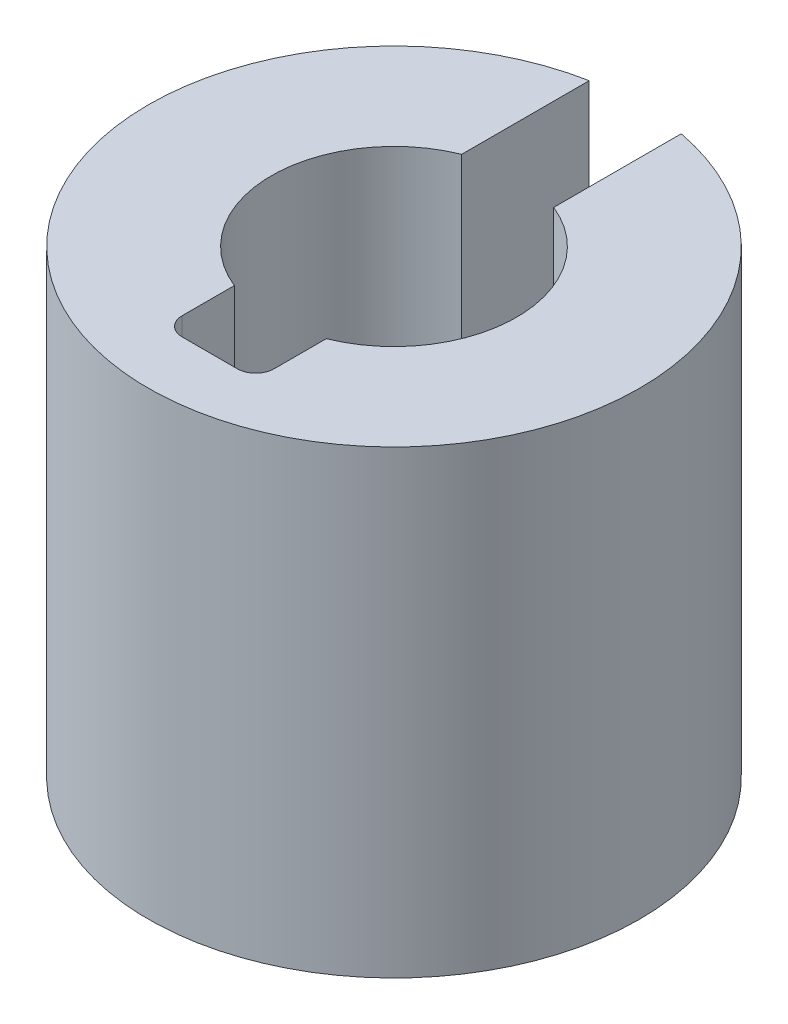
ISO-10303-21;
HEADER;
FILE_DESCRIPTION(('STEP AP214'),'2;1');
FILE_NAME('part.step','',(''),(''),'','','');
FILE_SCHEMA(('AUTOMOTIVE_DESIGN { 1 0 10303 214 1 1 1 1 }'));
ENDSEC;
DATA;
#1=APPLICATION_CONTEXT('core data for automotive mechanical design processes');
#2=APPLICATION_PROTOCOL_DEFINITION('international standard','automotive_design',2000,#1);
#3=PRODUCT_CONTEXT('',#1,'mechanical');
#4=PRODUCT('Part','Part','',(#3));
#5=PRODUCT_RELATED_PRODUCT_CATEGORY('part','',(#4));
#6=PRODUCT_DEFINITION_FORMATION('','',#4);
#7=PRODUCT_DEFINITION_CONTEXT('part definition',#1,'design');
#8=PRODUCT_DEFINITION('design','',#6,#7);
#9=PRODUCT_DEFINITION_SHAPE('','',#8);
#10=(LENGTH_UNIT() NAMED_UNIT(*) SI_UNIT(.MILLI.,.METRE.));
#11=(NAMED_UNIT(*) PLANE_ANGLE_UNIT() SI_UNIT($,.RADIAN.));
#12=(NAMED_UNIT(*) SI_UNIT($,.STERADIAN.) SOLID_ANGLE_UNIT());
#13=UNCERTAINTY_MEASURE_WITH_UNIT(LENGTH_MEASURE(1.E-05),#10,'distance_accuracy_value','');
#14=(GEOMETRIC_REPRESENTATION_CONTEXT(3) GLOBAL_UNCERTAINTY_ASSIGNED_CONTEXT((#13)) GLOBAL_UNIT_ASSIGNED_CONTEXT((#10,
#11,#12)) REPRESENTATION_CONTEXT('',''));
#15=CARTESIAN_POINT('',(0.,0.,0.));
#16=DIRECTION('',(0.,0.,1.));
#17=DIRECTION('',(1.,0.,0.));
#18=AXIS2_PLACEMENT_3D('',#15,#16,#17);
#19=CARTESIAN_POINT('',(-0.75,3.75,3.005));
#20=DIRECTION('',(0.,0.,1.));
#21=DIRECTION('',(1.,0.,0.));
#22=AXIS2_PLACEMENT_3D('',#19,#20,#21);
#23=PLANE('',#22);
#24=DIRECTION('',(0.,1.,0.));
#25=VECTOR('',#24,1.);
#26=CARTESIAN_POINT('',(-0.45,3.75,3.005));
#27=LINE('',#26,#25);
#28=CARTESIAN_POINT('',(-0.45,-3.75,3.005));
#29=VERTEX_POINT('',#28);
#30=CARTESIAN_POINT('',(-0.45,3.75,3.005));
#31=VERTEX_POINT('',#30);
#32=EDGE_CURVE('E115',#29,#31,#27,.T.);
#33=ORIENTED_EDGE('',*,*,#32,.T.);
#34=DIRECTION('',(1.,0.,0.));
#35=VECTOR('',#34,1.);
#36=CARTESIAN_POINT('',(-0.75,3.75,3.005));
#37=LINE('',#36,#35);
#38=CARTESIAN_POINT('',(0.45,3.75,3.005));
#39=VERTEX_POINT('',#38);
#40=EDGE_CURVE('E103',#39,#31,#37,.F.);
#41=ORIENTED_EDGE('',*,*,#40,.F.);
#42=DIRECTION('',(0.,1.,0.));
#43=VECTOR('',#42,1.);
#44=CARTESIAN_POINT('',(0.45,3.75,3.005));
#45=LINE('',#44,#43);
#46=CARTESIAN_POINT('',(0.45,-3.75,3.005));
#47=VERTEX_POINT('',#46);
#48=EDGE_CURVE('E102',#39,#47,#45,.F.);
#49=ORIENTED_EDGE('',*,*,#48,.T.);
#50=DIRECTION('',(1.,0.,0.));
#51=VECTOR('',#50,1.);
#52=CARTESIAN_POINT('',(-0.75,-3.75,3.005));
#53=LINE('',#52,#51);
#54=EDGE_CURVE('E92',#29,#47,#53,.T.);
#55=ORIENTED_EDGE('',*,*,#54,.F.);
#56=EDGE_LOOP('',(#33,#41,#49,#55));
#57=FACE_BOUND('',#56,.T.);
#58=ADVANCED_FACE('F17',(#57),#23,.F.);
#59=CARTESIAN_POINT('',(0.45,3.75,2.705));
#60=DIRECTION('',(0.,1.,0.));
#61=DIRECTION('',(0.,0.,1.));
#62=AXIS2_PLACEMENT_3D('',#59,#60,#61);
#63=CYLINDRICAL_SURFACE('',#62,0.3);
#64=DIRECTION('',(0.,1.,0.));
#65=VECTOR('',#64,1.);
#66=CARTESIAN_POINT('',(0.75,3.75,2.705));
#67=LINE('',#66,#65);
#68=CARTESIAN_POINT('',(0.75,3.75,2.705));
#69=VERTEX_POINT('',#68);
#70=CARTESIAN_POINT('',(0.75,-3.75,2.705));
#71=VERTEX_POINT('',#70);
#72=EDGE_CURVE('E112',#69,#71,#67,.F.);
#73=ORIENTED_EDGE('',*,*,#72,.T.);
#74=CARTESIAN_POINT('',(0.45,-3.75,2.705));
#75=DIRECTION('',(0.,1.,0.));
#76=DIRECTION('',(0.,0.,1.));
#77=AXIS2_PLACEMENT_3D('',#74,#75,#76);
#78=CIRCLE('',#77,0.3);
#79=EDGE_CURVE('E20',#47,#71,#78,.T.);
#80=ORIENTED_EDGE('',*,*,#79,.F.);
#81=ORIENTED_EDGE('',*,*,#48,.F.);
#82=CARTESIAN_POINT('',(0.45,3.75,2.705));
#83=DIRECTION('',(0.,1.,0.));
#84=DIRECTION('',(0.,0.,1.));
#85=AXIS2_PLACEMENT_3D('',#82,#83,#84);
#86=CIRCLE('',#85,0.3);
#87=EDGE_CURVE('E114',#69,#39,#86,.F.);
#88=ORIENTED_EDGE('',*,*,#87,.F.);
#89=EDGE_LOOP('',(#73,#80,#81,#88));
#90=FACE_BOUND('',#89,.T.);
#91=ADVANCED_FACE('F110',(#90),#63,.F.);
#92=CARTESIAN_POINT('',(-0.45,3.75,2.705));
#93=DIRECTION('',(0.,1.,0.));
#94=DIRECTION('',(0.,0.,1.));
#95=AXIS2_PLACEMENT_3D('',#92,#93,#94);
#96=CYLINDRICAL_SURFACE('',#95,0.3);
#97=ORIENTED_EDGE('',*,*,#32,.F.);
#98=CARTESIAN_POINT('',(-0.45,-3.75,2.705));
#99=DIRECTION('',(0.,1.,0.));
#100=DIRECTION('',(0.,0.,1.));
#101=AXIS2_PLACEMENT_3D('',#98,#99,#100);
#102=CIRCLE('',#101,0.3);
#103=CARTESIAN_POINT('',(-0.75,-3.75,2.705));
#104=VERTEX_POINT('',#103);
#105=EDGE_CURVE('E98',#104,#29,#102,.T.);
#106=ORIENTED_EDGE('',*,*,#105,.F.);
#107=DIRECTION('',(0.,1.,0.));
#108=VECTOR('',#107,1.);
#109=CARTESIAN_POINT('',(-0.75,3.75,2.705));
#110=LINE('',#109,#108);
#111=CARTESIAN_POINT('',(-0.75,3.75,2.705));
#112=VERTEX_POINT('',#111);
#113=EDGE_CURVE('E146',#104,#112,#110,.T.);
#114=ORIENTED_EDGE('',*,*,#113,.T.);
#115=CARTESIAN_POINT('',(-0.45,3.75,2.705));
#116=DIRECTION('',(0.,1.,0.));
#117=DIRECTION('',(0.,0.,1.));
#118=AXIS2_PLACEMENT_3D('',#115,#116,#117);
#119=CIRCLE('',#118,0.3);
#120=EDGE_CURVE('E118',#31,#112,#119,.F.);
#121=ORIENTED_EDGE('',*,*,#120,.F.);
#122=EDGE_LOOP('',(#97,#106,#114,#121));
#123=FACE_BOUND('',#122,.T.);
#124=ADVANCED_FACE('F184',(#123),#96,.F.);
#125=CARTESIAN_POINT('',(0.75,3.75,3.005));
#126=DIRECTION('',(1.,0.,0.));
#127=DIRECTION('',(0.,0.,-1.));
#128=AXIS2_PLACEMENT_3D('',#125,#126,#127);
#129=PLANE('',#128);
#130=ORIENTED_EDGE('',*,*,#72,.F.);
#131=DIRECTION('',(0.,0.,-1.));
#132=VECTOR('',#131,1.);
#133=CARTESIAN_POINT('',(0.75,3.75,3.005));
#134=LINE('',#133,#132);
#135=CARTESIAN_POINT('',(0.75,3.75,1.85404962177392));
#136=VERTEX_POINT('',#135);
#137=EDGE_CURVE('E120',#136,#69,#134,.F.);
#138=ORIENTED_EDGE('',*,*,#137,.F.);
#139=DIRECTION('',(0.,-1.,0.));
#140=VECTOR('',#139,1.);
#141=CARTESIAN_POINT('',(0.75,3.75,1.85404962177392));
#142=LINE('',#141,#140);
#143=CARTESIAN_POINT('',(0.75,-3.75,1.85404962177392));
#144=VERTEX_POINT('',#143);
#145=EDGE_CURVE('E154',#136,#144,#142,.T.);
#146=ORIENTED_EDGE('',*,*,#145,.T.);
#147=DIRECTION('',(0.,0.,-1.));
#148=VECTOR('',#147,1.);
#149=CARTESIAN_POINT('',(0.75,-3.75,3.005));
#150=LINE('',#149,#148);
#151=EDGE_CURVE('E145',#71,#144,#150,.T.);
#152=ORIENTED_EDGE('',*,*,#151,.F.);
#153=EDGE_LOOP('',(#130,#138,#146,#152));
#154=FACE_BOUND('',#153,.T.);
#155=ADVANCED_FACE('F181',(#154),#129,.F.);
#156=CARTESIAN_POINT('',(-0.75,3.75,3.005));
#157=DIRECTION('',(-1.,0.,0.));
#158=DIRECTION('',(0.,0.,1.));
#159=AXIS2_PLACEMENT_3D('',#156,#157,#158);
#160=PLANE('',#159);
#161=ORIENTED_EDGE('',*,*,#113,.F.);
#162=DIRECTION('',(0.,0.,1.));
#163=VECTOR('',#162,1.);
#164=CARTESIAN_POINT('',(-0.75,-3.75,3.005));
#165=LINE('',#164,#163);
#166=CARTESIAN_POINT('',(-0.75,-3.75,1.85404962177392));
#167=VERTEX_POINT('',#166);
#168=EDGE_CURVE('E150',#167,#104,#165,.T.);
#169=ORIENTED_EDGE('',*,*,#168,.F.);
#170=DIRECTION('',(0.,-1.,0.));
#171=VECTOR('',#170,1.);
#172=CARTESIAN_POINT('',(-0.749999999999999,3.75,1.85404962177392));
#173=LINE('',#172,#171);
#174=CARTESIAN_POINT('',(-0.75,3.75,1.85404962177392));
#175=VERTEX_POINT('',#174);
#176=EDGE_CURVE('E124',#167,#175,#173,.F.);
#177=ORIENTED_EDGE('',*,*,#176,.T.);
#178=DIRECTION('',(0.,0.,1.));
#179=VECTOR('',#178,1.);
#180=CARTESIAN_POINT('',(-0.75,3.75,3.005));
#181=LINE('',#180,#179);
#182=EDGE_CURVE('E149',#112,#175,#181,.F.);
#183=ORIENTED_EDGE('',*,*,#182,.F.);
#184=EDGE_LOOP('',(#161,#169,#177,#183));
#185=FACE_BOUND('',#184,.T.);
#186=ADVANCED_FACE('F183',(#185),#160,.F.);
#187=CARTESIAN_POINT('',(0.,3.75,0.));
#188=DIRECTION('',(0.,-1.,0.));
#189=DIRECTION('',(0.,0.,-1.));
#190=AXIS2_PLACEMENT_3D('',#187,#188,#189);
#191=CYLINDRICAL_SURFACE('',#190,2.);
#192=ORIENTED_EDGE('',*,*,#145,.F.);
#193=CARTESIAN_POINT('',(0.,3.75,0.));
#194=DIRECTION('',(0.,-1.,0.));
#195=DIRECTION('',(0.,0.,-1.));
#196=AXIS2_PLACEMENT_3D('',#193,#194,#195);
#197=CIRCLE('',#196,2.);
#198=CARTESIAN_POINT('',(0.75,3.75,-1.85404962177392));
#199=VERTEX_POINT('',#198);
#200=EDGE_CURVE('E128',#199,#136,#197,.T.);
#201=ORIENTED_EDGE('',*,*,#200,.F.);
#202=DIRECTION('',(0.,1.,0.));
#203=VECTOR('',#202,1.);
#204=CARTESIAN_POINT('',(0.75,3.75,-1.85404962177392));
#205=LINE('',#204,#203);
#206=CARTESIAN_POINT('',(0.75,-3.75,-1.85404962177392));
#207=VERTEX_POINT('',#206);
#208=EDGE_CURVE('E127',#199,#207,#205,.F.);
#209=ORIENTED_EDGE('',*,*,#208,.T.);
#210=CARTESIAN_POINT('',(0.,-3.75,0.));
#211=DIRECTION('',(0.,-1.,0.));
#212=DIRECTION('',(0.,0.,-1.));
#213=AXIS2_PLACEMENT_3D('',#210,#211,#212);
#214=CIRCLE('',#213,2.);
#215=EDGE_CURVE('E123',#207,#144,#214,.T.);
#216=ORIENTED_EDGE('',*,*,#215,.T.);
#217=EDGE_LOOP('',(#192,#201,#209,#216));
#218=FACE_BOUND('',#217,.T.);
#219=ADVANCED_FACE('F179',(#218),#191,.F.);
#220=CARTESIAN_POINT('',(0.,3.75,0.));
#221=DIRECTION('',(0.,-1.,0.));
#222=DIRECTION('',(0.,0.,-1.));
#223=AXIS2_PLACEMENT_3D('',#220,#221,#222);
#224=CYLINDRICAL_SURFACE('',#223,2.);
#225=DIRECTION('',(0.,1.,0.));
#226=VECTOR('',#225,1.);
#227=CARTESIAN_POINT('',(-0.75,3.75,-1.85404962177392));
#228=LINE('',#227,#226);
#229=CARTESIAN_POINT('',(-0.75,-3.75,-1.85404962177392));
#230=VERTEX_POINT('',#229);
#231=CARTESIAN_POINT('',(-0.75,3.75,-1.85404962177392));
#232=VERTEX_POINT('',#231);
#233=EDGE_CURVE('E161',#230,#232,#228,.T.);
#234=ORIENTED_EDGE('',*,*,#233,.T.);
#235=CARTESIAN_POINT('',(0.,3.75,0.));
#236=DIRECTION('',(0.,-1.,0.));
#237=DIRECTION('',(0.,0.,-1.));
#238=AXIS2_PLACEMENT_3D('',#235,#236,#237);
#239=CIRCLE('',#238,2.);
#240=EDGE_CURVE('E131',#175,#232,#239,.T.);
#241=ORIENTED_EDGE('',*,*,#240,.F.);
#242=ORIENTED_EDGE('',*,*,#176,.F.);
#243=CARTESIAN_POINT('',(0.,-3.75,0.));
#244=DIRECTION('',(0.,-1.,0.));
#245=DIRECTION('',(0.,0.,-1.));
#246=AXIS2_PLACEMENT_3D('',#243,#244,#245);
#247=CIRCLE('',#246,2.);
#248=EDGE_CURVE('E121',#167,#230,#247,.T.);
#249=ORIENTED_EDGE('',*,*,#248,.T.);
#250=EDGE_LOOP('',(#234,#241,#242,#249));
#251=FACE_BOUND('',#250,.T.);
#252=ADVANCED_FACE('F212',(#251),#224,.F.);
#253=CARTESIAN_POINT('',(0.,-3.75,0.));
#254=DIRECTION('',(0.,1.,0.));
#255=DIRECTION('',(0.,0.,1.));
#256=AXIS2_PLACEMENT_3D('',#253,#254,#255);
#257=PLANE('',#256);
#258=DIRECTION('',(0.,0.,-1.));
#259=VECTOR('',#258,1.);
#260=CARTESIAN_POINT('',(0.75,-3.75,-1.85404962177392));
#261=LINE('',#260,#259);
#262=CARTESIAN_POINT('',(0.75,-3.75,-3.9341485737069));
#263=VERTEX_POINT('',#262);
#264=EDGE_CURVE('E132',#207,#263,#261,.T.);
#265=ORIENTED_EDGE('',*,*,#264,.T.);
#266=CARTESIAN_POINT('',(0.,-3.75,0.));
#267=DIRECTION('',(0.,-1.,0.));
#268=DIRECTION('',(0.,0.,-1.));
#269=AXIS2_PLACEMENT_3D('',#266,#267,#268);
#270=CIRCLE('',#269,4.005);
#271=CARTESIAN_POINT('',(-0.75,-3.75,-3.9341485737069));
#272=VERTEX_POINT('',#271);
#273=EDGE_CURVE('E135',#272,#263,#270,.F.);
#274=ORIENTED_EDGE('',*,*,#273,.F.);
#275=DIRECTION('',(0.,0.,1.));
#276=VECTOR('',#275,1.);
#277=CARTESIAN_POINT('',(-0.75,-3.75,-1.85404962177392));
#278=LINE('',#277,#276);
#279=EDGE_CURVE('E139',#272,#230,#278,.T.);
#280=ORIENTED_EDGE('',*,*,#279,.T.);
#281=ORIENTED_EDGE('',*,*,#248,.F.);
#282=ORIENTED_EDGE('',*,*,#168,.T.);
#283=ORIENTED_EDGE('',*,*,#105,.T.);
#284=ORIENTED_EDGE('',*,*,#54,.T.);
#285=ORIENTED_EDGE('',*,*,#79,.T.);
#286=ORIENTED_EDGE('',*,*,#151,.T.);
#287=ORIENTED_EDGE('',*,*,#215,.F.);
#288=EDGE_LOOP('',(#265,#274,#280,#281,#282,#283,#284,#285,#286,#287));
#289=FACE_BOUND('',#288,.T.);
#290=ADVANCED_FACE('F94',(#289),#257,.F.);
#291=CARTESIAN_POINT('',(0.75,3.75,-1.85404962177392));
#292=DIRECTION('',(1.,0.,0.));
#293=DIRECTION('',(0.,0.,-1.));
#294=AXIS2_PLACEMENT_3D('',#291,#292,#293);
#295=PLANE('',#294);
#296=ORIENTED_EDGE('',*,*,#208,.F.);
#297=DIRECTION('',(0.,0.,1.));
#298=VECTOR('',#297,1.);
#299=CARTESIAN_POINT('',(0.75,3.75,0.));
#300=LINE('',#299,#298);
#301=CARTESIAN_POINT('',(0.75,3.75,-3.9341485737069));
#302=VERTEX_POINT('',#301);
#303=EDGE_CURVE('E134',#302,#199,#300,.T.);
#304=ORIENTED_EDGE('',*,*,#303,.F.);
#305=DIRECTION('',(0.,-1.,0.));
#306=VECTOR('',#305,1.);
#307=CARTESIAN_POINT('',(0.75,3.75,-3.9341485737069));
#308=LINE('',#307,#306);
#309=EDGE_CURVE('E138',#263,#302,#308,.F.);
#310=ORIENTED_EDGE('',*,*,#309,.F.);
#311=ORIENTED_EDGE('',*,*,#264,.F.);
#312=EDGE_LOOP('',(#296,#304,#310,#311));
#313=FACE_BOUND('',#312,.T.);
#314=ADVANCED_FACE('F174',(#313),#295,.F.);
#315=CARTESIAN_POINT('',(0.,3.75,0.));
#316=DIRECTION('',(0.,1.,0.));
#317=DIRECTION('',(0.,0.,1.));
#318=AXIS2_PLACEMENT_3D('',#315,#316,#317);
#319=PLANE('',#318);
#320=CARTESIAN_POINT('',(0.,3.75,0.));
#321=DIRECTION('',(0.,-1.,0.));
#322=DIRECTION('',(0.,0.,-1.));
#323=AXIS2_PLACEMENT_3D('',#320,#321,#322);
#324=CIRCLE('',#323,4.005);
#325=CARTESIAN_POINT('',(-0.75,3.75,-3.9341485737069));
#326=VERTEX_POINT('',#325);
#327=EDGE_CURVE('E26',#302,#326,#324,.T.);
#328=ORIENTED_EDGE('',*,*,#327,.F.);
#329=ORIENTED_EDGE('',*,*,#303,.T.);
#330=ORIENTED_EDGE('',*,*,#200,.T.);
#331=ORIENTED_EDGE('',*,*,#137,.T.);
#332=ORIENTED_EDGE('',*,*,#87,.T.);
#333=ORIENTED_EDGE('',*,*,#40,.T.);
#334=ORIENTED_EDGE('',*,*,#120,.T.);
#335=ORIENTED_EDGE('',*,*,#182,.T.);
#336=ORIENTED_EDGE('',*,*,#240,.T.);
#337=DIRECTION('',(0.,0.,1.));
#338=VECTOR('',#337,1.);
#339=CARTESIAN_POINT('',(-0.75,3.75,-1.85404962177392));
#340=LINE('',#339,#338);
#341=EDGE_CURVE('E35',#232,#326,#340,.F.);
#342=ORIENTED_EDGE('',*,*,#341,.T.);
#343=EDGE_LOOP('',(#328,#329,#330,#331,#332,#333,#334,#335,#336,#342));
#344=FACE_BOUND('',#343,.T.);
#345=ADVANCED_FACE('F170',(#344),#319,.T.);
#346=CARTESIAN_POINT('',(-0.75,3.75,-1.85404962177392));
#347=DIRECTION('',(-1.,0.,0.));
#348=DIRECTION('',(0.,0.,1.));
#349=AXIS2_PLACEMENT_3D('',#346,#347,#348);
#350=PLANE('',#349);
#351=DIRECTION('',(0.,-1.,0.));
#352=VECTOR('',#351,1.);
#353=CARTESIAN_POINT('',(-0.75,3.75,-3.9341485737069));
#354=LINE('',#353,#352);
#355=EDGE_CURVE('E11',#326,#272,#354,.T.);
#356=ORIENTED_EDGE('',*,*,#355,.F.);
#357=ORIENTED_EDGE('',*,*,#341,.F.);
#358=ORIENTED_EDGE('',*,*,#233,.F.);
#359=ORIENTED_EDGE('',*,*,#279,.F.);
#360=EDGE_LOOP('',(#356,#357,#358,#359));
#361=FACE_BOUND('',#360,.T.);
#362=ADVANCED_FACE('F197',(#361),#350,.F.);
#363=CARTESIAN_POINT('',(0.,3.75,0.));
#364=DIRECTION('',(0.,-1.,0.));
#365=DIRECTION('',(0.,0.,-1.));
#366=AXIS2_PLACEMENT_3D('',#363,#364,#365);
#367=CYLINDRICAL_SURFACE('',#366,4.005);
#368=ORIENTED_EDGE('',*,*,#327,.T.);
#369=ORIENTED_EDGE('',*,*,#355,.T.);
#370=ORIENTED_EDGE('',*,*,#273,.T.);
#371=ORIENTED_EDGE('',*,*,#309,.T.);
#372=EDGE_LOOP('',(#368,#369,#370,#371));
#373=FACE_BOUND('',#372,.T.);
#374=ADVANCED_FACE('F195',(#373),#367,.T.);
#375=CLOSED_SHELL('',(#58,#91,#124,#155,#186,#219,#252,#290,#314,#345,#362,#374));
#376=MANIFOLD_SOLID_BREP('B1',#375);
#377=ADVANCED_BREP_SHAPE_REPRESENTATION('',(#18,#376),#14);
#378=SHAPE_DEFINITION_REPRESENTATION(#9,#377);
ENDSEC;
END-ISO-10303-21;
